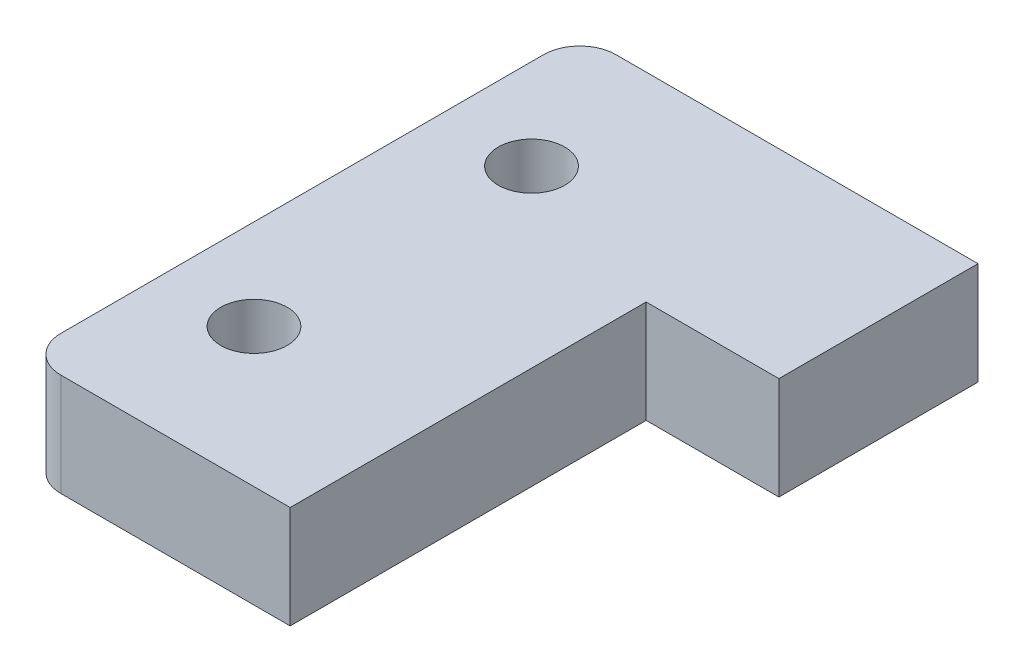
ISO-10303-21;
HEADER;
FILE_DESCRIPTION(('STEP AP214'),'2;1');
FILE_NAME('part.step','',(''),(''),'','','');
FILE_SCHEMA(('AUTOMOTIVE_DESIGN { 1 0 10303 214 1 1 1 1 }'));
ENDSEC;
DATA;
#1=APPLICATION_CONTEXT('core data for automotive mechanical design processes');
#2=APPLICATION_PROTOCOL_DEFINITION('international standard','automotive_design',2000,#1);
#3=PRODUCT_CONTEXT('',#1,'mechanical');
#4=PRODUCT('Part','Part','',(#3));
#5=PRODUCT_RELATED_PRODUCT_CATEGORY('part','',(#4));
#6=PRODUCT_DEFINITION_FORMATION('','',#4);
#7=PRODUCT_DEFINITION_CONTEXT('part definition',#1,'design');
#8=PRODUCT_DEFINITION('design','',#6,#7);
#9=PRODUCT_DEFINITION_SHAPE('','',#8);
#10=(LENGTH_UNIT() NAMED_UNIT(*) SI_UNIT(.MILLI.,.METRE.));
#11=(NAMED_UNIT(*) PLANE_ANGLE_UNIT() SI_UNIT($,.RADIAN.));
#12=(NAMED_UNIT(*) SI_UNIT($,.STERADIAN.) SOLID_ANGLE_UNIT());
#13=UNCERTAINTY_MEASURE_WITH_UNIT(LENGTH_MEASURE(1.E-05),#10,'distance_accuracy_value','');
#14=(GEOMETRIC_REPRESENTATION_CONTEXT(3) GLOBAL_UNCERTAINTY_ASSIGNED_CONTEXT((#13)) GLOBAL_UNIT_ASSIGNED_CONTEXT((#10,
#11,#12)) REPRESENTATION_CONTEXT('',''));
#15=CARTESIAN_POINT('',(0.,0.,0.));
#16=DIRECTION('',(0.,0.,1.));
#17=DIRECTION('',(1.,0.,0.));
#18=AXIS2_PLACEMENT_3D('',#15,#16,#17);
#19=CARTESIAN_POINT('',(-13.5,8.5,-20.));
#20=DIRECTION('',(0.,1.,0.));
#21=DIRECTION('',(0.,0.,1.));
#22=AXIS2_PLACEMENT_3D('',#19,#20,#21);
#23=PLANE('',#22);
#24=CARTESIAN_POINT('',(-9.,8.5,-11.5));
#25=DIRECTION('',(0.,1.,0.));
#26=DIRECTION('',(0.,0.,1.));
#27=AXIS2_PLACEMENT_3D('',#24,#25,#26);
#28=CIRCLE('',#27,2.75);
#29=CARTESIAN_POINT('',(-9.,8.5,-8.75));
#30=VERTEX_POINT('',#29);
#31=EDGE_CURVE('E146',#30,#30,#28,.T.);
#32=ORIENTED_EDGE('',*,*,#31,.F.);
#33=EDGE_LOOP('',(#32));
#34=FACE_BOUND('',#33,.T.);
#35=CARTESIAN_POINT('',(-13.5,8.5,-20.));
#36=DIRECTION('',(0.,1.,0.));
#37=DIRECTION('',(0.,0.,1.));
#38=AXIS2_PLACEMENT_3D('',#35,#36,#37);
#39=CIRCLE('',#38,3.);
#40=CARTESIAN_POINT('',(-13.5,8.5,-23.));
#41=VERTEX_POINT('',#40);
#42=CARTESIAN_POINT('',(-16.5,8.5,-20.));
#43=VERTEX_POINT('',#42);
#44=EDGE_CURVE('E164',#41,#43,#39,.T.);
#45=ORIENTED_EDGE('',*,*,#44,.T.);
#46=DIRECTION('',(0.,0.,1.));
#47=VECTOR('',#46,1.);
#48=CARTESIAN_POINT('',(-16.5,8.5,-20.));
#49=LINE('',#48,#47);
#50=CARTESIAN_POINT('',(-16.5,8.5,20.));
#51=VERTEX_POINT('',#50);
#52=EDGE_CURVE('E100',#43,#51,#49,.T.);
#53=ORIENTED_EDGE('',*,*,#52,.T.);
#54=CARTESIAN_POINT('',(-13.5,8.5,20.));
#55=DIRECTION('',(0.,1.,0.));
#56=DIRECTION('',(0.,0.,1.));
#57=AXIS2_PLACEMENT_3D('',#54,#55,#56);
#58=CIRCLE('',#57,3.);
#59=CARTESIAN_POINT('',(-13.5,8.5,23.));
#60=VERTEX_POINT('',#59);
#61=EDGE_CURVE('E185',#51,#60,#58,.T.);
#62=ORIENTED_EDGE('',*,*,#61,.T.);
#63=DIRECTION('',(1.,0.,0.));
#64=VECTOR('',#63,1.);
#65=CARTESIAN_POINT('',(-13.5,8.5,23.));
#66=LINE('',#65,#64);
#67=CARTESIAN_POINT('',(5.5,8.5,23.));
#68=VERTEX_POINT('',#67);
#69=EDGE_CURVE('E199',#60,#68,#66,.T.);
#70=ORIENTED_EDGE('',*,*,#69,.T.);
#71=DIRECTION('',(0.,0.,-1.));
#72=VECTOR('',#71,1.);
#73=CARTESIAN_POINT('',(5.5,8.5,23.));
#74=LINE('',#73,#72);
#75=CARTESIAN_POINT('',(5.5,8.5,-6.5));
#76=VERTEX_POINT('',#75);
#77=EDGE_CURVE('E119',#68,#76,#74,.T.);
#78=ORIENTED_EDGE('',*,*,#77,.T.);
#79=DIRECTION('',(1.,0.,0.));
#80=VECTOR('',#79,1.);
#81=CARTESIAN_POINT('',(5.5,8.5,-6.5));
#82=LINE('',#81,#80);
#83=CARTESIAN_POINT('',(16.5,8.5,-6.5));
#84=VERTEX_POINT('',#83);
#85=EDGE_CURVE('E113',#76,#84,#82,.T.);
#86=ORIENTED_EDGE('',*,*,#85,.T.);
#87=DIRECTION('',(0.,0.,-1.));
#88=VECTOR('',#87,1.);
#89=CARTESIAN_POINT('',(16.5,8.5,-6.5));
#90=LINE('',#89,#88);
#91=CARTESIAN_POINT('',(16.5,8.5,-23.));
#92=VERTEX_POINT('',#91);
#93=EDGE_CURVE('E117',#84,#92,#90,.T.);
#94=ORIENTED_EDGE('',*,*,#93,.T.);
#95=DIRECTION('',(-1.,0.,0.));
#96=VECTOR('',#95,1.);
#97=CARTESIAN_POINT('',(16.5,8.5,-23.));
#98=LINE('',#97,#96);
#99=EDGE_CURVE('E57',#92,#41,#98,.T.);
#100=ORIENTED_EDGE('',*,*,#99,.T.);
#101=EDGE_LOOP('',(#45,#53,#62,#70,#78,#86,#94,#100));
#102=FACE_BOUND('',#101,.T.);
#103=CARTESIAN_POINT('',(-9.,8.5,11.5));
#104=DIRECTION('',(0.,1.,0.));
#105=DIRECTION('',(0.,0.,1.));
#106=AXIS2_PLACEMENT_3D('',#103,#104,#105);
#107=CIRCLE('',#106,2.75);
#108=CARTESIAN_POINT('',(-9.,8.5,14.25));
#109=VERTEX_POINT('',#108);
#110=EDGE_CURVE('E213',#109,#109,#107,.T.);
#111=ORIENTED_EDGE('',*,*,#110,.F.);
#112=EDGE_LOOP('',(#111));
#113=FACE_BOUND('',#112,.T.);
#114=ADVANCED_FACE('F39',(#34,#102,#113),#23,.T.);
#115=CARTESIAN_POINT('',(-13.5,0.,-20.));
#116=DIRECTION('',(0.,1.,0.));
#117=DIRECTION('',(0.,0.,1.));
#118=AXIS2_PLACEMENT_3D('',#115,#116,#117);
#119=PLANE('',#118);
#120=CARTESIAN_POINT('',(-13.5,0.,-20.));
#121=DIRECTION('',(0.,1.,0.));
#122=DIRECTION('',(0.,0.,1.));
#123=AXIS2_PLACEMENT_3D('',#120,#121,#122);
#124=CIRCLE('',#123,3.);
#125=CARTESIAN_POINT('',(-13.5,0.,-23.));
#126=VERTEX_POINT('',#125);
#127=CARTESIAN_POINT('',(-16.5,0.,-20.));
#128=VERTEX_POINT('',#127);
#129=EDGE_CURVE('E141',#126,#128,#124,.T.);
#130=ORIENTED_EDGE('',*,*,#129,.F.);
#131=DIRECTION('',(-1.,0.,0.));
#132=VECTOR('',#131,1.);
#133=CARTESIAN_POINT('',(16.5,0.,-23.));
#134=LINE('',#133,#132);
#135=CARTESIAN_POINT('',(16.5,0.,-23.));
#136=VERTEX_POINT('',#135);
#137=EDGE_CURVE('E92',#136,#126,#134,.T.);
#138=ORIENTED_EDGE('',*,*,#137,.F.);
#139=DIRECTION('',(0.,0.,-1.));
#140=VECTOR('',#139,1.);
#141=CARTESIAN_POINT('',(16.5,0.,-6.5));
#142=LINE('',#141,#140);
#143=CARTESIAN_POINT('',(16.5,0.,-6.5));
#144=VERTEX_POINT('',#143);
#145=EDGE_CURVE('E86',#144,#136,#142,.T.);
#146=ORIENTED_EDGE('',*,*,#145,.F.);
#147=DIRECTION('',(1.,0.,0.));
#148=VECTOR('',#147,1.);
#149=CARTESIAN_POINT('',(5.5,0.,-6.5));
#150=LINE('',#149,#148);
#151=CARTESIAN_POINT('',(5.5,0.,-6.5));
#152=VERTEX_POINT('',#151);
#153=EDGE_CURVE('E128',#152,#144,#150,.T.);
#154=ORIENTED_EDGE('',*,*,#153,.F.);
#155=DIRECTION('',(0.,0.,-1.));
#156=VECTOR('',#155,1.);
#157=CARTESIAN_POINT('',(5.5,0.,23.));
#158=LINE('',#157,#156);
#159=CARTESIAN_POINT('',(5.5,0.,23.));
#160=VERTEX_POINT('',#159);
#161=EDGE_CURVE('E155',#160,#152,#158,.T.);
#162=ORIENTED_EDGE('',*,*,#161,.F.);
#163=DIRECTION('',(1.,0.,0.));
#164=VECTOR('',#163,1.);
#165=CARTESIAN_POINT('',(-13.5,0.,23.));
#166=LINE('',#165,#164);
#167=CARTESIAN_POINT('',(-13.5,0.,23.));
#168=VERTEX_POINT('',#167);
#169=EDGE_CURVE('E152',#168,#160,#166,.T.);
#170=ORIENTED_EDGE('',*,*,#169,.F.);
#171=CARTESIAN_POINT('',(-13.5,0.,20.));
#172=DIRECTION('',(0.,1.,0.));
#173=DIRECTION('',(0.,0.,1.));
#174=AXIS2_PLACEMENT_3D('',#171,#172,#173);
#175=CIRCLE('',#174,3.);
#176=CARTESIAN_POINT('',(-16.5,0.,20.));
#177=VERTEX_POINT('',#176);
#178=EDGE_CURVE('E149',#177,#168,#175,.T.);
#179=ORIENTED_EDGE('',*,*,#178,.F.);
#180=DIRECTION('',(0.,0.,1.));
#181=VECTOR('',#180,1.);
#182=CARTESIAN_POINT('',(-16.5,0.,-20.));
#183=LINE('',#182,#181);
#184=EDGE_CURVE('E145',#128,#177,#183,.T.);
#185=ORIENTED_EDGE('',*,*,#184,.F.);
#186=EDGE_LOOP('',(#130,#138,#146,#154,#162,#170,#179,#185));
#187=FACE_BOUND('',#186,.T.);
#188=CARTESIAN_POINT('',(-9.,0.,-11.5));
#189=DIRECTION('',(0.,1.,0.));
#190=DIRECTION('',(0.,0.,1.));
#191=AXIS2_PLACEMENT_3D('',#188,#189,#190);
#192=CIRCLE('',#191,2.75);
#193=CARTESIAN_POINT('',(-9.,0.,-8.75));
#194=VERTEX_POINT('',#193);
#195=EDGE_CURVE('E209',#194,#194,#192,.T.);
#196=ORIENTED_EDGE('',*,*,#195,.T.);
#197=EDGE_LOOP('',(#196));
#198=FACE_BOUND('',#197,.T.);
#199=CARTESIAN_POINT('',(-9.,0.,11.5));
#200=DIRECTION('',(0.,1.,0.));
#201=DIRECTION('',(0.,0.,1.));
#202=AXIS2_PLACEMENT_3D('',#199,#200,#201);
#203=CIRCLE('',#202,2.75);
#204=CARTESIAN_POINT('',(-9.,0.,14.25));
#205=VERTEX_POINT('',#204);
#206=EDGE_CURVE('E217',#205,#205,#203,.T.);
#207=ORIENTED_EDGE('',*,*,#206,.T.);
#208=EDGE_LOOP('',(#207));
#209=FACE_BOUND('',#208,.T.);
#210=ADVANCED_FACE('F189',(#187,#198,#209),#119,.F.);
#211=CARTESIAN_POINT('',(-13.5,8.5,-20.));
#212=DIRECTION('',(0.,-1.,0.));
#213=DIRECTION('',(0.,0.,-1.));
#214=AXIS2_PLACEMENT_3D('',#211,#212,#213);
#215=CYLINDRICAL_SURFACE('',#214,3.);
#216=ORIENTED_EDGE('',*,*,#129,.T.);
#217=DIRECTION('',(0.,-1.,0.));
#218=VECTOR('',#217,1.);
#219=CARTESIAN_POINT('',(-16.5,8.5,-20.));
#220=LINE('',#219,#218);
#221=EDGE_CURVE('E11',#43,#128,#220,.T.);
#222=ORIENTED_EDGE('',*,*,#221,.F.);
#223=ORIENTED_EDGE('',*,*,#44,.F.);
#224=DIRECTION('',(0.,-1.,0.));
#225=VECTOR('',#224,1.);
#226=CARTESIAN_POINT('',(-13.5,8.5,-23.));
#227=LINE('',#226,#225);
#228=EDGE_CURVE('E137',#41,#126,#227,.T.);
#229=ORIENTED_EDGE('',*,*,#228,.T.);
#230=EDGE_LOOP('',(#216,#222,#223,#229));
#231=FACE_BOUND('',#230,.T.);
#232=ADVANCED_FACE('F41',(#231),#215,.T.);
#233=CARTESIAN_POINT('',(-16.5,8.5,-20.));
#234=DIRECTION('',(1.,0.,0.));
#235=DIRECTION('',(0.,0.,-1.));
#236=AXIS2_PLACEMENT_3D('',#233,#234,#235);
#237=PLANE('',#236);
#238=ORIENTED_EDGE('',*,*,#184,.T.);
#239=DIRECTION('',(0.,-1.,0.));
#240=VECTOR('',#239,1.);
#241=CARTESIAN_POINT('',(-16.5,8.5,20.));
#242=LINE('',#241,#240);
#243=EDGE_CURVE('E49',#51,#177,#242,.T.);
#244=ORIENTED_EDGE('',*,*,#243,.F.);
#245=ORIENTED_EDGE('',*,*,#52,.F.);
#246=ORIENTED_EDGE('',*,*,#221,.T.);
#247=EDGE_LOOP('',(#238,#244,#245,#246));
#248=FACE_BOUND('',#247,.T.);
#249=ADVANCED_FACE('F251',(#248),#237,.F.);
#250=CARTESIAN_POINT('',(-13.5,8.5,20.));
#251=DIRECTION('',(0.,-1.,0.));
#252=DIRECTION('',(0.,0.,-1.));
#253=AXIS2_PLACEMENT_3D('',#250,#251,#252);
#254=CYLINDRICAL_SURFACE('',#253,3.);
#255=ORIENTED_EDGE('',*,*,#178,.T.);
#256=DIRECTION('',(0.,-1.,0.));
#257=VECTOR('',#256,1.);
#258=CARTESIAN_POINT('',(-13.5,8.5,23.));
#259=LINE('',#258,#257);
#260=EDGE_CURVE('E175',#60,#168,#259,.T.);
#261=ORIENTED_EDGE('',*,*,#260,.F.);
#262=ORIENTED_EDGE('',*,*,#61,.F.);
#263=ORIENTED_EDGE('',*,*,#243,.T.);
#264=EDGE_LOOP('',(#255,#261,#262,#263));
#265=FACE_BOUND('',#264,.T.);
#266=ADVANCED_FACE('F183',(#265),#254,.T.);
#267=CARTESIAN_POINT('',(-13.5,8.5,23.));
#268=DIRECTION('',(0.,0.,-1.));
#269=DIRECTION('',(-1.,0.,0.));
#270=AXIS2_PLACEMENT_3D('',#267,#268,#269);
#271=PLANE('',#270);
#272=ORIENTED_EDGE('',*,*,#169,.T.);
#273=DIRECTION('',(0.,-1.,0.));
#274=VECTOR('',#273,1.);
#275=CARTESIAN_POINT('',(5.5,8.5,23.));
#276=LINE('',#275,#274);
#277=EDGE_CURVE('E171',#68,#160,#276,.T.);
#278=ORIENTED_EDGE('',*,*,#277,.F.);
#279=ORIENTED_EDGE('',*,*,#69,.F.);
#280=ORIENTED_EDGE('',*,*,#260,.T.);
#281=EDGE_LOOP('',(#272,#278,#279,#280));
#282=FACE_BOUND('',#281,.T.);
#283=ADVANCED_FACE('F194',(#282),#271,.F.);
#284=CARTESIAN_POINT('',(5.5,8.5,23.));
#285=DIRECTION('',(-1.,0.,0.));
#286=DIRECTION('',(0.,0.,1.));
#287=AXIS2_PLACEMENT_3D('',#284,#285,#286);
#288=PLANE('',#287);
#289=ORIENTED_EDGE('',*,*,#161,.T.);
#290=DIRECTION('',(0.,-1.,0.));
#291=VECTOR('',#290,1.);
#292=CARTESIAN_POINT('',(5.5,8.5,-6.5));
#293=LINE('',#292,#291);
#294=EDGE_CURVE('E130',#76,#152,#293,.T.);
#295=ORIENTED_EDGE('',*,*,#294,.F.);
#296=ORIENTED_EDGE('',*,*,#77,.F.);
#297=ORIENTED_EDGE('',*,*,#277,.T.);
#298=EDGE_LOOP('',(#289,#295,#296,#297));
#299=FACE_BOUND('',#298,.T.);
#300=ADVANCED_FACE('F197',(#299),#288,.F.);
#301=CARTESIAN_POINT('',(5.5,8.5,-6.5));
#302=DIRECTION('',(0.,0.,-1.));
#303=DIRECTION('',(-1.,0.,0.));
#304=AXIS2_PLACEMENT_3D('',#301,#302,#303);
#305=PLANE('',#304);
#306=ORIENTED_EDGE('',*,*,#153,.T.);
#307=DIRECTION('',(0.,-1.,0.));
#308=VECTOR('',#307,1.);
#309=CARTESIAN_POINT('',(16.5,8.5,-6.5));
#310=LINE('',#309,#308);
#311=EDGE_CURVE('E125',#84,#144,#310,.T.);
#312=ORIENTED_EDGE('',*,*,#311,.F.);
#313=ORIENTED_EDGE('',*,*,#85,.F.);
#314=ORIENTED_EDGE('',*,*,#294,.T.);
#315=EDGE_LOOP('',(#306,#312,#313,#314));
#316=FACE_BOUND('',#315,.T.);
#317=ADVANCED_FACE('F126',(#316),#305,.F.);
#318=CARTESIAN_POINT('',(16.5,8.5,-6.5));
#319=DIRECTION('',(-1.,0.,0.));
#320=DIRECTION('',(0.,0.,1.));
#321=AXIS2_PLACEMENT_3D('',#318,#319,#320);
#322=PLANE('',#321);
#323=ORIENTED_EDGE('',*,*,#145,.T.);
#324=DIRECTION('',(0.,-1.,0.));
#325=VECTOR('',#324,1.);
#326=CARTESIAN_POINT('',(16.5,8.5,-23.));
#327=LINE('',#326,#325);
#328=EDGE_CURVE('E131',#92,#136,#327,.T.);
#329=ORIENTED_EDGE('',*,*,#328,.F.);
#330=ORIENTED_EDGE('',*,*,#93,.F.);
#331=ORIENTED_EDGE('',*,*,#311,.T.);
#332=EDGE_LOOP('',(#323,#329,#330,#331));
#333=FACE_BOUND('',#332,.T.);
#334=ADVANCED_FACE('F133',(#333),#322,.F.);
#335=CARTESIAN_POINT('',(16.5,8.5,-23.));
#336=DIRECTION('',(0.,0.,1.));
#337=DIRECTION('',(1.,0.,0.));
#338=AXIS2_PLACEMENT_3D('',#335,#336,#337);
#339=PLANE('',#338);
#340=ORIENTED_EDGE('',*,*,#137,.T.);
#341=ORIENTED_EDGE('',*,*,#228,.F.);
#342=ORIENTED_EDGE('',*,*,#99,.F.);
#343=ORIENTED_EDGE('',*,*,#328,.T.);
#344=EDGE_LOOP('',(#340,#341,#342,#343));
#345=FACE_BOUND('',#344,.T.);
#346=ADVANCED_FACE('F239',(#345),#339,.F.);
#347=CARTESIAN_POINT('',(-9.,8.5,-11.5));
#348=DIRECTION('',(0.,-1.,0.));
#349=DIRECTION('',(0.,0.,-1.));
#350=AXIS2_PLACEMENT_3D('',#347,#348,#349);
#351=CYLINDRICAL_SURFACE('',#350,2.75);
#352=ORIENTED_EDGE('',*,*,#31,.T.);
#353=EDGE_LOOP('',(#352));
#354=FACE_BOUND('',#353,.T.);
#355=ORIENTED_EDGE('',*,*,#195,.F.);
#356=EDGE_LOOP('',(#355));
#357=FACE_BOUND('',#356,.T.);
#358=ADVANCED_FACE('F236',(#354,#357),#351,.F.);
#359=CARTESIAN_POINT('',(-9.,8.5,11.5));
#360=DIRECTION('',(0.,-1.,0.));
#361=DIRECTION('',(0.,0.,-1.));
#362=AXIS2_PLACEMENT_3D('',#359,#360,#361);
#363=CYLINDRICAL_SURFACE('',#362,2.75);
#364=ORIENTED_EDGE('',*,*,#110,.T.);
#365=EDGE_LOOP('',(#364));
#366=FACE_BOUND('',#365,.T.);
#367=ORIENTED_EDGE('',*,*,#206,.F.);
#368=EDGE_LOOP('',(#367));
#369=FACE_BOUND('',#368,.T.);
#370=ADVANCED_FACE('F225',(#366,#369),#363,.F.);
#371=CLOSED_SHELL('',(#114,#210,#232,#249,#266,#283,#300,#317,#334,#346,#358,#370));
#372=MANIFOLD_SOLID_BREP('B2',#371);
#373=ADVANCED_BREP_SHAPE_REPRESENTATION('',(#18,#372),#14);
#374=SHAPE_DEFINITION_REPRESENTATION(#9,#373);
ENDSEC;
END-ISO-10303-21;
